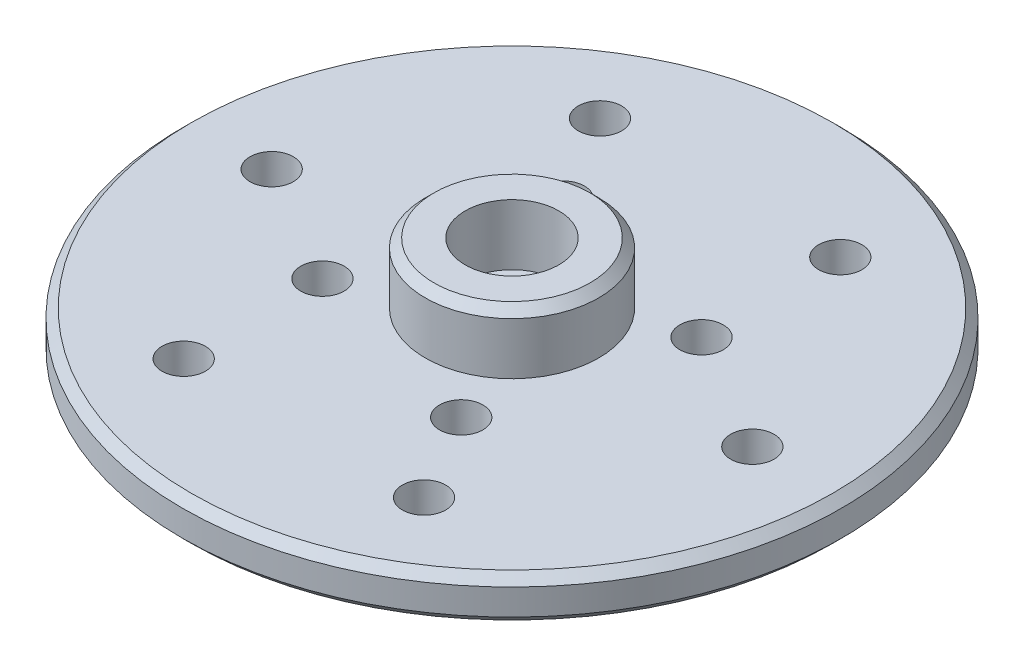
ISO-10303-21;
HEADER;
FILE_DESCRIPTION(('STEP AP214'),'2;1');
FILE_NAME('part.step','',(''),(''),'','','');
FILE_SCHEMA(('AUTOMOTIVE_DESIGN { 1 0 10303 214 1 1 1 1 }'));
ENDSEC;
DATA;
#1=APPLICATION_CONTEXT('core data for automotive mechanical design processes');
#2=APPLICATION_PROTOCOL_DEFINITION('international standard','automotive_design',2000,#1);
#3=PRODUCT_CONTEXT('',#1,'mechanical');
#4=PRODUCT('Part','Part','',(#3));
#5=PRODUCT_RELATED_PRODUCT_CATEGORY('part','',(#4));
#6=PRODUCT_DEFINITION_FORMATION('','',#4);
#7=PRODUCT_DEFINITION_CONTEXT('part definition',#1,'design');
#8=PRODUCT_DEFINITION('design','',#6,#7);
#9=PRODUCT_DEFINITION_SHAPE('','',#8);
#10=(LENGTH_UNIT() NAMED_UNIT(*) SI_UNIT(.MILLI.,.METRE.));
#11=(NAMED_UNIT(*) PLANE_ANGLE_UNIT() SI_UNIT($,.RADIAN.));
#12=(NAMED_UNIT(*) SI_UNIT($,.STERADIAN.) SOLID_ANGLE_UNIT());
#13=UNCERTAINTY_MEASURE_WITH_UNIT(LENGTH_MEASURE(1.E-05),#10,'distance_accuracy_value','');
#14=(GEOMETRIC_REPRESENTATION_CONTEXT(3) GLOBAL_UNCERTAINTY_ASSIGNED_CONTEXT((#13)) GLOBAL_UNIT_ASSIGNED_CONTEXT((#10,
#11,#12)) REPRESENTATION_CONTEXT('',''));
#15=CARTESIAN_POINT('',(0.,0.,0.));
#16=DIRECTION('',(0.,0.,1.));
#17=DIRECTION('',(1.,0.,0.));
#18=AXIS2_PLACEMENT_3D('',#15,#16,#17);
#19=CARTESIAN_POINT('',(0.,5.50000000004047,0.));
#20=DIRECTION('',(0.,-1.,0.));
#21=DIRECTION('',(0.,0.,-1.));
#22=AXIS2_PLACEMENT_3D('',#19,#20,#21);
#23=CONICAL_SURFACE('',#22,4.99999999999545,0.785398163397448);
#24=CARTESIAN_POINT('',(0.,5.49999999999999,0.));
#25=DIRECTION('',(0.,-1.,0.));
#26=DIRECTION('',(0.,0.,-1.));
#27=AXIS2_PLACEMENT_3D('',#24,#25,#26);
#28=CIRCLE('',#27,5.);
#29=CARTESIAN_POINT('',(0.,5.49999999999999,-5.));
#30=VERTEX_POINT('',#29);
#31=EDGE_CURVE('E28',#30,#30,#28,.T.);
#32=ORIENTED_EDGE('',*,*,#31,.F.);
#33=EDGE_LOOP('',(#32));
#34=FACE_BOUND('',#33,.T.);
#35=CARTESIAN_POINT('',(0.,6.00000000002865,0.));
#36=DIRECTION('',(0.,-1.,0.));
#37=DIRECTION('',(0.,0.,-1.));
#38=AXIS2_PLACEMENT_3D('',#35,#36,#37);
#39=CIRCLE('',#38,4.50000000000728);
#40=CARTESIAN_POINT('',(0.,6.00000000002865,-4.50000000000728));
#41=VERTEX_POINT('',#40);
#42=EDGE_CURVE('E16',#41,#41,#39,.F.);
#43=ORIENTED_EDGE('',*,*,#42,.F.);
#44=EDGE_LOOP('',(#43));
#45=FACE_BOUND('',#44,.T.);
#46=ADVANCED_FACE('F13',(#34,#45),#23,.T.);
#47=CARTESIAN_POINT('',(0.,6.,0.));
#48=DIRECTION('',(0.,1.,0.));
#49=DIRECTION('',(0.,0.,1.));
#50=AXIS2_PLACEMENT_3D('',#47,#48,#49);
#51=PLANE('',#50);
#52=CARTESIAN_POINT('',(0.,6.,0.));
#53=DIRECTION('',(0.,-1.,0.));
#54=DIRECTION('',(0.,0.,-1.));
#55=AXIS2_PLACEMENT_3D('',#52,#53,#54);
#56=CIRCLE('',#55,2.7);
#57=CARTESIAN_POINT('',(0.,6.,-2.7));
#58=VERTEX_POINT('',#57);
#59=EDGE_CURVE('E103',#58,#58,#56,.T.);
#60=ORIENTED_EDGE('',*,*,#59,.T.);
#61=EDGE_LOOP('',(#60));
#62=FACE_BOUND('',#61,.T.);
#63=ORIENTED_EDGE('',*,*,#42,.T.);
#64=EDGE_LOOP('',(#63));
#65=FACE_BOUND('',#64,.T.);
#66=ADVANCED_FACE('F114',(#62,#65),#51,.T.);
#67=CARTESIAN_POINT('',(0.,2.00000000000002,0.));
#68=DIRECTION('',(0.,-1.,0.));
#69=DIRECTION('',(0.,0.,-1.));
#70=AXIS2_PLACEMENT_3D('',#67,#68,#69);
#71=CONICAL_SURFACE('',#70,19.0000000009398,0.785398163397445);
#72=CARTESIAN_POINT('',(0.,2.00000000000002,0.));
#73=DIRECTION('',(0.,-1.,0.));
#74=DIRECTION('',(0.,0.,-1.));
#75=AXIS2_PLACEMENT_3D('',#72,#73,#74);
#76=CIRCLE('',#75,19.0000000009398);
#77=CARTESIAN_POINT('',(0.,2.00000000000002,-19.0000000009398));
#78=VERTEX_POINT('',#77);
#79=EDGE_CURVE('E102',#78,#78,#76,.T.);
#80=ORIENTED_EDGE('',*,*,#79,.F.);
#81=EDGE_LOOP('',(#80));
#82=FACE_BOUND('',#81,.T.);
#83=CARTESIAN_POINT('',(0.,2.5,0.));
#84=DIRECTION('',(0.,-1.,0.));
#85=DIRECTION('',(0.,0.,-1.));
#86=AXIS2_PLACEMENT_3D('',#83,#84,#85);
#87=CIRCLE('',#86,18.5000000009398);
#88=CARTESIAN_POINT('',(0.,2.5,-18.5000000009398));
#89=VERTEX_POINT('',#88);
#90=EDGE_CURVE('E100',#89,#89,#87,.F.);
#91=ORIENTED_EDGE('',*,*,#90,.F.);
#92=EDGE_LOOP('',(#91));
#93=FACE_BOUND('',#92,.T.);
#94=ADVANCED_FACE('F122',(#82,#93),#71,.T.);
#95=CARTESIAN_POINT('',(0.,6.,0.));
#96=DIRECTION('',(0.,-1.,0.));
#97=DIRECTION('',(0.,0.,-1.));
#98=AXIS2_PLACEMENT_3D('',#95,#96,#97);
#99=CYLINDRICAL_SURFACE('',#98,5.);
#100=CARTESIAN_POINT('',(0.,2.5,0.));
#101=DIRECTION('',(0.,-1.,0.));
#102=DIRECTION('',(0.,0.,-1.));
#103=AXIS2_PLACEMENT_3D('',#100,#101,#102);
#104=CIRCLE('',#103,5.);
#105=CARTESIAN_POINT('',(0.,2.5,-5.));
#106=VERTEX_POINT('',#105);
#107=EDGE_CURVE('E97',#106,#106,#104,.T.);
#108=ORIENTED_EDGE('',*,*,#107,.F.);
#109=EDGE_LOOP('',(#108));
#110=FACE_BOUND('',#109,.T.);
#111=ORIENTED_EDGE('',*,*,#31,.T.);
#112=EDGE_LOOP('',(#111));
#113=FACE_BOUND('',#112,.T.);
#114=ADVANCED_FACE('F193',(#110,#113),#99,.T.);
#115=CARTESIAN_POINT('',(0.,6.,0.));
#116=DIRECTION('',(0.,-1.,0.));
#117=DIRECTION('',(0.,0.,-1.));
#118=AXIS2_PLACEMENT_3D('',#115,#116,#117);
#119=CYLINDRICAL_SURFACE('',#118,2.7);
#120=CARTESIAN_POINT('',(0.,2.5,0.));
#121=DIRECTION('',(0.,-1.,0.));
#122=DIRECTION('',(0.,0.,-1.));
#123=AXIS2_PLACEMENT_3D('',#120,#121,#122);
#124=CIRCLE('',#123,2.7);
#125=CARTESIAN_POINT('',(0.,2.5,-2.7));
#126=VERTEX_POINT('',#125);
#127=EDGE_CURVE('E94',#126,#126,#124,.F.);
#128=ORIENTED_EDGE('',*,*,#127,.F.);
#129=EDGE_LOOP('',(#128));
#130=FACE_BOUND('',#129,.T.);
#131=ORIENTED_EDGE('',*,*,#59,.F.);
#132=EDGE_LOOP('',(#131));
#133=FACE_BOUND('',#132,.T.);
#134=ADVANCED_FACE('F189',(#130,#133),#119,.F.);
#135=CARTESIAN_POINT('',(0.,2.5,0.));
#136=DIRECTION('',(0.,-1.,0.));
#137=DIRECTION('',(0.,0.,-1.));
#138=AXIS2_PLACEMENT_3D('',#135,#136,#137);
#139=CYLINDRICAL_SURFACE('',#138,19.0000000009398);
#140=ORIENTED_EDGE('',*,*,#79,.T.);
#141=EDGE_LOOP('',(#140));
#142=FACE_BOUND('',#141,.T.);
#143=CARTESIAN_POINT('',(0.,0.499999999999997,0.));
#144=DIRECTION('',(0.,1.,0.));
#145=DIRECTION('',(0.,0.,1.));
#146=AXIS2_PLACEMENT_3D('',#143,#144,#145);
#147=CIRCLE('',#146,19.0000000009398);
#148=CARTESIAN_POINT('',(0.,0.499999999999997,19.0000000009398));
#149=VERTEX_POINT('',#148);
#150=EDGE_CURVE('E93',#149,#149,#147,.F.);
#151=ORIENTED_EDGE('',*,*,#150,.F.);
#152=EDGE_LOOP('',(#151));
#153=FACE_BOUND('',#152,.T.);
#154=ADVANCED_FACE('F185',(#142,#153),#139,.T.);
#155=CARTESIAN_POINT('',(0.,2.5,0.));
#156=DIRECTION('',(0.,1.,0.));
#157=DIRECTION('',(0.,0.,1.));
#158=AXIS2_PLACEMENT_3D('',#155,#156,#157);
#159=PLANE('',#158);
#160=CARTESIAN_POINT('',(4.0000000009961,2.5,6.92820323018273));
#161=DIRECTION('',(0.,-1.,0.));
#162=DIRECTION('',(0.,0.,-1.));
#163=AXIS2_PLACEMENT_3D('',#160,#161,#162);
#164=CIRCLE('',#163,1.24999999999886);
#165=CARTESIAN_POINT('',(4.0000000009961,2.5,5.67820323018386));
#166=VERTEX_POINT('',#165);
#167=EDGE_CURVE('E66',#166,#166,#164,.T.);
#168=ORIENTED_EDGE('',*,*,#167,.T.);
#169=EDGE_LOOP('',(#168));
#170=FACE_BOUND('',#169,.T.);
#171=CARTESIAN_POINT('',(-6.92820323019561,2.5,4.00000000097478));
#172=DIRECTION('',(0.,-1.,0.));
#173=DIRECTION('',(0.,0.,-1.));
#174=AXIS2_PLACEMENT_3D('',#171,#172,#173);
#175=CIRCLE('',#174,1.24999999999886);
#176=CARTESIAN_POINT('',(-6.92820323019561,2.5,2.75000000097592));
#177=VERTEX_POINT('',#176);
#178=EDGE_CURVE('E72',#177,#177,#175,.T.);
#179=ORIENTED_EDGE('',*,*,#178,.T.);
#180=EDGE_LOOP('',(#179));
#181=FACE_BOUND('',#180,.T.);
#182=CARTESIAN_POINT('',(-4.0000000010032,2.5,-6.92820323017962));
#183=DIRECTION('',(0.,-1.,0.));
#184=DIRECTION('',(0.,0.,-1.));
#185=AXIS2_PLACEMENT_3D('',#182,#183,#184);
#186=CIRCLE('',#185,1.24999999999886);
#187=CARTESIAN_POINT('',(-4.0000000010032,2.5,-8.17820323017848));
#188=VERTEX_POINT('',#187);
#189=EDGE_CURVE('E78',#188,#188,#186,.T.);
#190=ORIENTED_EDGE('',*,*,#189,.T.);
#191=EDGE_LOOP('',(#190));
#192=FACE_BOUND('',#191,.T.);
#193=CARTESIAN_POINT('',(13.8564064603592,2.5,0.));
#194=DIRECTION('',(0.,-1.,0.));
#195=DIRECTION('',(0.,0.,-1.));
#196=AXIS2_PLACEMENT_3D('',#193,#194,#195);
#197=CIRCLE('',#196,1.24999999999886);
#198=CARTESIAN_POINT('',(13.8564064603592,2.5,-1.24999999999886));
#199=VERTEX_POINT('',#198);
#200=EDGE_CURVE('E84',#199,#199,#197,.T.);
#201=ORIENTED_EDGE('',*,*,#200,.T.);
#202=EDGE_LOOP('',(#201));
#203=FACE_BOUND('',#202,.T.);
#204=CARTESIAN_POINT('',(-6.9282032318263,2.5,-11.9999999995111));
#205=DIRECTION('',(0.,-1.,0.));
#206=DIRECTION('',(0.,0.,-1.));
#207=AXIS2_PLACEMENT_3D('',#204,#205,#206);
#208=CIRCLE('',#207,1.24999999999886);
#209=CARTESIAN_POINT('',(-6.9282032318263,2.5,-13.2499999995099));
#210=VERTEX_POINT('',#209);
#211=EDGE_CURVE('E90',#210,#210,#208,.T.);
#212=ORIENTED_EDGE('',*,*,#211,.T.);
#213=EDGE_LOOP('',(#212));
#214=FACE_BOUND('',#213,.T.);
#215=CARTESIAN_POINT('',(6.92820322963072,2.5,-11.9999999995111));
#216=DIRECTION('',(0.,-1.,0.));
#217=DIRECTION('',(0.,0.,-1.));
#218=AXIS2_PLACEMENT_3D('',#215,#216,#217);
#219=CIRCLE('',#218,1.24999999999886);
#220=CARTESIAN_POINT('',(6.92820322963072,2.5,-13.2499999995099));
#221=VERTEX_POINT('',#220);
#222=EDGE_CURVE('E87',#221,#221,#219,.T.);
#223=ORIENTED_EDGE('',*,*,#222,.T.);
#224=EDGE_LOOP('',(#223));
#225=FACE_BOUND('',#224,.T.);
#226=CARTESIAN_POINT('',(6.92820323019561,2.5,-4.00000000097478));
#227=DIRECTION('',(0.,-1.,0.));
#228=DIRECTION('',(0.,0.,-1.));
#229=AXIS2_PLACEMENT_3D('',#226,#227,#228);
#230=CIRCLE('',#229,1.24999999999886);
#231=CARTESIAN_POINT('',(6.92820323019561,2.5,-5.25000000097364));
#232=VERTEX_POINT('',#231);
#233=EDGE_CURVE('E81',#232,#232,#230,.T.);
#234=ORIENTED_EDGE('',*,*,#233,.T.);
#235=EDGE_LOOP('',(#234));
#236=FACE_BOUND('',#235,.T.);
#237=CARTESIAN_POINT('',(-13.8564064609028,2.5,0.));
#238=DIRECTION('',(0.,-1.,0.));
#239=DIRECTION('',(0.,0.,-1.));
#240=AXIS2_PLACEMENT_3D('',#237,#238,#239);
#241=CIRCLE('',#240,1.24999999999886);
#242=CARTESIAN_POINT('',(-13.8564064609028,2.5,-1.24999999999886));
#243=VERTEX_POINT('',#242);
#244=EDGE_CURVE('E75',#243,#243,#241,.T.);
#245=ORIENTED_EDGE('',*,*,#244,.T.);
#246=EDGE_LOOP('',(#245));
#247=FACE_BOUND('',#246,.T.);
#248=CARTESIAN_POINT('',(-6.92820323017784,2.5,11.9999999979203));
#249=DIRECTION('',(0.,-1.,0.));
#250=DIRECTION('',(0.,0.,-1.));
#251=AXIS2_PLACEMENT_3D('',#248,#249,#250);
#252=CIRCLE('',#251,1.24999999999886);
#253=CARTESIAN_POINT('',(-6.92820323017784,2.5,10.7499999979215));
#254=VERTEX_POINT('',#253);
#255=EDGE_CURVE('E69',#254,#254,#252,.T.);
#256=ORIENTED_EDGE('',*,*,#255,.T.);
#257=EDGE_LOOP('',(#256));
#258=FACE_BOUND('',#257,.T.);
#259=CARTESIAN_POINT('',(6.9282032318192,2.5,11.9999999995146));
#260=DIRECTION('',(0.,-1.,0.));
#261=DIRECTION('',(0.,0.,-1.));
#262=AXIS2_PLACEMENT_3D('',#259,#260,#261);
#263=CIRCLE('',#262,1.24999999999886);
#264=CARTESIAN_POINT('',(6.9282032318192,2.5,10.7499999995158));
#265=VERTEX_POINT('',#264);
#266=EDGE_CURVE('E63',#265,#265,#263,.T.);
#267=ORIENTED_EDGE('',*,*,#266,.T.);
#268=EDGE_LOOP('',(#267));
#269=FACE_BOUND('',#268,.T.);
#270=ORIENTED_EDGE('',*,*,#107,.T.);
#271=EDGE_LOOP('',(#270));
#272=FACE_BOUND('',#271,.T.);
#273=ORIENTED_EDGE('',*,*,#90,.T.);
#274=EDGE_LOOP('',(#273));
#275=FACE_BOUND('',#274,.T.);
#276=ADVANCED_FACE('F181',(#170,#181,#192,#203,#214,#225,#236,#247,#258,#269,#272,#275),#159,.T.);
#277=CARTESIAN_POINT('',(0.,2.5,0.));
#278=DIRECTION('',(0.,1.,0.));
#279=DIRECTION('',(0.,0.,1.));
#280=AXIS2_PLACEMENT_3D('',#277,#278,#279);
#281=PLANE('',#280);
#282=ORIENTED_EDGE('',*,*,#127,.T.);
#283=EDGE_LOOP('',(#282));
#284=FACE_BOUND('',#283,.T.);
#285=CARTESIAN_POINT('',(0.,2.5,0.));
#286=DIRECTION('',(0.,-1.,0.));
#287=DIRECTION('',(0.,0.,-1.));
#288=AXIS2_PLACEMENT_3D('',#285,#286,#287);
#289=CIRCLE('',#288,1.6);
#290=CARTESIAN_POINT('',(0.,2.5,-1.6));
#291=VERTEX_POINT('',#290);
#292=EDGE_CURVE('E60',#291,#291,#289,.T.);
#293=ORIENTED_EDGE('',*,*,#292,.T.);
#294=EDGE_LOOP('',(#293));
#295=FACE_BOUND('',#294,.T.);
#296=ADVANCED_FACE('F177',(#284,#295),#281,.T.);
#297=CARTESIAN_POINT('',(0.,0.499999999999997,0.));
#298=DIRECTION('',(0.,1.,0.));
#299=DIRECTION('',(0.,0.,1.));
#300=AXIS2_PLACEMENT_3D('',#297,#298,#299);
#301=CONICAL_SURFACE('',#300,19.0000000009398,0.785398163397452);
#302=CARTESIAN_POINT('',(0.,0.,0.));
#303=DIRECTION('',(0.,1.,0.));
#304=DIRECTION('',(0.,0.,1.));
#305=AXIS2_PLACEMENT_3D('',#302,#303,#304);
#306=CIRCLE('',#305,18.5000000009398);
#307=CARTESIAN_POINT('',(0.,0.,18.5000000009398));
#308=VERTEX_POINT('',#307);
#309=EDGE_CURVE('E57',#308,#308,#306,.T.);
#310=ORIENTED_EDGE('',*,*,#309,.T.);
#311=EDGE_LOOP('',(#310));
#312=FACE_BOUND('',#311,.T.);
#313=ORIENTED_EDGE('',*,*,#150,.T.);
#314=EDGE_LOOP('',(#313));
#315=FACE_BOUND('',#314,.T.);
#316=ADVANCED_FACE('F173',(#312,#315),#301,.T.);
#317=CARTESIAN_POINT('',(-6.9282032318263,2.5,-11.9999999995111));
#318=DIRECTION('',(0.,-1.,0.));
#319=DIRECTION('',(0.,0.,-1.));
#320=AXIS2_PLACEMENT_3D('',#317,#318,#319);
#321=CYLINDRICAL_SURFACE('',#320,1.24999999999886);
#322=CARTESIAN_POINT('',(-6.9282032318263,0.,-11.9999999995111));
#323=DIRECTION('',(0.,-1.,0.));
#324=DIRECTION('',(0.,0.,-1.));
#325=AXIS2_PLACEMENT_3D('',#322,#323,#324);
#326=CIRCLE('',#325,1.24999999999886);
#327=CARTESIAN_POINT('',(-6.9282032318263,0.,-13.2499999995099));
#328=VERTEX_POINT('',#327);
#329=EDGE_CURVE('E54',#328,#328,#326,.T.);
#330=ORIENTED_EDGE('',*,*,#329,.T.);
#331=EDGE_LOOP('',(#330));
#332=FACE_BOUND('',#331,.T.);
#333=ORIENTED_EDGE('',*,*,#211,.F.);
#334=EDGE_LOOP('',(#333));
#335=FACE_BOUND('',#334,.T.);
#336=ADVANCED_FACE('F169',(#332,#335),#321,.F.);
#337=CARTESIAN_POINT('',(6.92820322963072,2.5,-11.9999999995111));
#338=DIRECTION('',(0.,-1.,0.));
#339=DIRECTION('',(0.,0.,-1.));
#340=AXIS2_PLACEMENT_3D('',#337,#338,#339);
#341=CYLINDRICAL_SURFACE('',#340,1.24999999999886);
#342=CARTESIAN_POINT('',(6.92820322963072,0.,-11.9999999995111));
#343=DIRECTION('',(0.,-1.,0.));
#344=DIRECTION('',(0.,0.,-1.));
#345=AXIS2_PLACEMENT_3D('',#342,#343,#344);
#346=CIRCLE('',#345,1.24999999999886);
#347=CARTESIAN_POINT('',(6.92820322963072,0.,-13.2499999995099));
#348=VERTEX_POINT('',#347);
#349=EDGE_CURVE('E51',#348,#348,#346,.T.);
#350=ORIENTED_EDGE('',*,*,#349,.T.);
#351=EDGE_LOOP('',(#350));
#352=FACE_BOUND('',#351,.T.);
#353=ORIENTED_EDGE('',*,*,#222,.F.);
#354=EDGE_LOOP('',(#353));
#355=FACE_BOUND('',#354,.T.);
#356=ADVANCED_FACE('F165',(#352,#355),#341,.F.);
#357=CARTESIAN_POINT('',(13.8564064603592,2.5,0.));
#358=DIRECTION('',(0.,-1.,0.));
#359=DIRECTION('',(0.,0.,-1.));
#360=AXIS2_PLACEMENT_3D('',#357,#358,#359);
#361=CYLINDRICAL_SURFACE('',#360,1.24999999999886);
#362=CARTESIAN_POINT('',(13.8564064603592,0.,0.));
#363=DIRECTION('',(0.,-1.,0.));
#364=DIRECTION('',(0.,0.,-1.));
#365=AXIS2_PLACEMENT_3D('',#362,#363,#364);
#366=CIRCLE('',#365,1.24999999999886);
#367=CARTESIAN_POINT('',(13.8564064603592,0.,-1.24999999999886));
#368=VERTEX_POINT('',#367);
#369=EDGE_CURVE('E48',#368,#368,#366,.T.);
#370=ORIENTED_EDGE('',*,*,#369,.T.);
#371=EDGE_LOOP('',(#370));
#372=FACE_BOUND('',#371,.T.);
#373=ORIENTED_EDGE('',*,*,#200,.F.);
#374=EDGE_LOOP('',(#373));
#375=FACE_BOUND('',#374,.T.);
#376=ADVANCED_FACE('F161',(#372,#375),#361,.F.);
#377=CARTESIAN_POINT('',(6.92820323019561,2.5,-4.00000000097478));
#378=DIRECTION('',(0.,-1.,0.));
#379=DIRECTION('',(0.,0.,-1.));
#380=AXIS2_PLACEMENT_3D('',#377,#378,#379);
#381=CYLINDRICAL_SURFACE('',#380,1.24999999999886);
#382=CARTESIAN_POINT('',(6.92820323019561,0.,-4.00000000097478));
#383=DIRECTION('',(0.,-1.,0.));
#384=DIRECTION('',(0.,0.,-1.));
#385=AXIS2_PLACEMENT_3D('',#382,#383,#384);
#386=CIRCLE('',#385,1.24999999999886);
#387=CARTESIAN_POINT('',(6.92820323019561,0.,-5.25000000097364));
#388=VERTEX_POINT('',#387);
#389=EDGE_CURVE('E45',#388,#388,#386,.T.);
#390=ORIENTED_EDGE('',*,*,#389,.T.);
#391=EDGE_LOOP('',(#390));
#392=FACE_BOUND('',#391,.T.);
#393=ORIENTED_EDGE('',*,*,#233,.F.);
#394=EDGE_LOOP('',(#393));
#395=FACE_BOUND('',#394,.T.);
#396=ADVANCED_FACE('F157',(#392,#395),#381,.F.);
#397=CARTESIAN_POINT('',(-4.0000000010032,2.5,-6.92820323017962));
#398=DIRECTION('',(0.,-1.,0.));
#399=DIRECTION('',(0.,0.,-1.));
#400=AXIS2_PLACEMENT_3D('',#397,#398,#399);
#401=CYLINDRICAL_SURFACE('',#400,1.24999999999886);
#402=CARTESIAN_POINT('',(-4.0000000010032,0.,-6.92820323017962));
#403=DIRECTION('',(0.,-1.,0.));
#404=DIRECTION('',(0.,0.,-1.));
#405=AXIS2_PLACEMENT_3D('',#402,#403,#404);
#406=CIRCLE('',#405,1.24999999999886);
#407=CARTESIAN_POINT('',(-4.0000000010032,0.,-8.17820323017848));
#408=VERTEX_POINT('',#407);
#409=EDGE_CURVE('E42',#408,#408,#406,.T.);
#410=ORIENTED_EDGE('',*,*,#409,.T.);
#411=EDGE_LOOP('',(#410));
#412=FACE_BOUND('',#411,.T.);
#413=ORIENTED_EDGE('',*,*,#189,.F.);
#414=EDGE_LOOP('',(#413));
#415=FACE_BOUND('',#414,.T.);
#416=ADVANCED_FACE('F153',(#412,#415),#401,.F.);
#417=CARTESIAN_POINT('',(-13.8564064609028,2.5,0.));
#418=DIRECTION('',(0.,-1.,0.));
#419=DIRECTION('',(0.,0.,-1.));
#420=AXIS2_PLACEMENT_3D('',#417,#418,#419);
#421=CYLINDRICAL_SURFACE('',#420,1.24999999999886);
#422=CARTESIAN_POINT('',(-13.8564064609028,0.,0.));
#423=DIRECTION('',(0.,-1.,0.));
#424=DIRECTION('',(0.,0.,-1.));
#425=AXIS2_PLACEMENT_3D('',#422,#423,#424);
#426=CIRCLE('',#425,1.24999999999886);
#427=CARTESIAN_POINT('',(-13.8564064609028,0.,-1.24999999999886));
#428=VERTEX_POINT('',#427);
#429=EDGE_CURVE('E39',#428,#428,#426,.T.);
#430=ORIENTED_EDGE('',*,*,#429,.T.);
#431=EDGE_LOOP('',(#430));
#432=FACE_BOUND('',#431,.T.);
#433=ORIENTED_EDGE('',*,*,#244,.F.);
#434=EDGE_LOOP('',(#433));
#435=FACE_BOUND('',#434,.T.);
#436=ADVANCED_FACE('F149',(#432,#435),#421,.F.);
#437=CARTESIAN_POINT('',(-6.92820323019561,2.5,4.00000000097478));
#438=DIRECTION('',(0.,-1.,0.));
#439=DIRECTION('',(0.,0.,-1.));
#440=AXIS2_PLACEMENT_3D('',#437,#438,#439);
#441=CYLINDRICAL_SURFACE('',#440,1.24999999999886);
#442=CARTESIAN_POINT('',(-6.92820323019561,0.,4.00000000097478));
#443=DIRECTION('',(0.,-1.,0.));
#444=DIRECTION('',(0.,0.,-1.));
#445=AXIS2_PLACEMENT_3D('',#442,#443,#444);
#446=CIRCLE('',#445,1.24999999999886);
#447=CARTESIAN_POINT('',(-6.92820323019561,0.,2.75000000097592));
#448=VERTEX_POINT('',#447);
#449=EDGE_CURVE('E36',#448,#448,#446,.T.);
#450=ORIENTED_EDGE('',*,*,#449,.T.);
#451=EDGE_LOOP('',(#450));
#452=FACE_BOUND('',#451,.T.);
#453=ORIENTED_EDGE('',*,*,#178,.F.);
#454=EDGE_LOOP('',(#453));
#455=FACE_BOUND('',#454,.T.);
#456=ADVANCED_FACE('F145',(#452,#455),#441,.F.);
#457=CARTESIAN_POINT('',(-6.92820323017784,2.5,11.9999999979203));
#458=DIRECTION('',(0.,-1.,0.));
#459=DIRECTION('',(0.,0.,-1.));
#460=AXIS2_PLACEMENT_3D('',#457,#458,#459);
#461=CYLINDRICAL_SURFACE('',#460,1.24999999999886);
#462=CARTESIAN_POINT('',(-6.92820323017784,0.,11.9999999979203));
#463=DIRECTION('',(0.,-1.,0.));
#464=DIRECTION('',(0.,0.,-1.));
#465=AXIS2_PLACEMENT_3D('',#462,#463,#464);
#466=CIRCLE('',#465,1.24999999999886);
#467=CARTESIAN_POINT('',(-6.92820323017784,0.,10.7499999979215));
#468=VERTEX_POINT('',#467);
#469=EDGE_CURVE('E33',#468,#468,#466,.T.);
#470=ORIENTED_EDGE('',*,*,#469,.T.);
#471=EDGE_LOOP('',(#470));
#472=FACE_BOUND('',#471,.T.);
#473=ORIENTED_EDGE('',*,*,#255,.F.);
#474=EDGE_LOOP('',(#473));
#475=FACE_BOUND('',#474,.T.);
#476=ADVANCED_FACE('F141',(#472,#475),#461,.F.);
#477=CARTESIAN_POINT('',(4.0000000009961,2.5,6.92820323018273));
#478=DIRECTION('',(0.,-1.,0.));
#479=DIRECTION('',(0.,0.,-1.));
#480=AXIS2_PLACEMENT_3D('',#477,#478,#479);
#481=CYLINDRICAL_SURFACE('',#480,1.24999999999886);
#482=CARTESIAN_POINT('',(4.0000000009961,0.,6.92820323018273));
#483=DIRECTION('',(0.,-1.,0.));
#484=DIRECTION('',(0.,0.,-1.));
#485=AXIS2_PLACEMENT_3D('',#482,#483,#484);
#486=CIRCLE('',#485,1.24999999999886);
#487=CARTESIAN_POINT('',(4.0000000009961,0.,5.67820323018386));
#488=VERTEX_POINT('',#487);
#489=EDGE_CURVE('E25',#488,#488,#486,.T.);
#490=ORIENTED_EDGE('',*,*,#489,.T.);
#491=EDGE_LOOP('',(#490));
#492=FACE_BOUND('',#491,.T.);
#493=ORIENTED_EDGE('',*,*,#167,.F.);
#494=EDGE_LOOP('',(#493));
#495=FACE_BOUND('',#494,.T.);
#496=ADVANCED_FACE('F137',(#492,#495),#481,.F.);
#497=CARTESIAN_POINT('',(6.9282032318192,2.5,11.9999999995146));
#498=DIRECTION('',(0.,-1.,0.));
#499=DIRECTION('',(0.,0.,-1.));
#500=AXIS2_PLACEMENT_3D('',#497,#498,#499);
#501=CYLINDRICAL_SURFACE('',#500,1.24999999999886);
#502=CARTESIAN_POINT('',(6.9282032318192,0.,11.9999999995146));
#503=DIRECTION('',(0.,-1.,0.));
#504=DIRECTION('',(0.,0.,-1.));
#505=AXIS2_PLACEMENT_3D('',#502,#503,#504);
#506=CIRCLE('',#505,1.24999999999886);
#507=CARTESIAN_POINT('',(6.9282032318192,0.,10.7499999995158));
#508=VERTEX_POINT('',#507);
#509=EDGE_CURVE('E20',#508,#508,#506,.T.);
#510=ORIENTED_EDGE('',*,*,#509,.T.);
#511=EDGE_LOOP('',(#510));
#512=FACE_BOUND('',#511,.T.);
#513=ORIENTED_EDGE('',*,*,#266,.F.);
#514=EDGE_LOOP('',(#513));
#515=FACE_BOUND('',#514,.T.);
#516=ADVANCED_FACE('F131',(#512,#515),#501,.F.);
#517=CARTESIAN_POINT('',(0.,2.5,0.));
#518=DIRECTION('',(0.,-1.,0.));
#519=DIRECTION('',(0.,0.,-1.));
#520=AXIS2_PLACEMENT_3D('',#517,#518,#519);
#521=CYLINDRICAL_SURFACE('',#520,1.6);
#522=CARTESIAN_POINT('',(0.,0.,0.));
#523=DIRECTION('',(0.,-1.,0.));
#524=DIRECTION('',(0.,0.,-1.));
#525=AXIS2_PLACEMENT_3D('',#522,#523,#524);
#526=CIRCLE('',#525,1.6);
#527=CARTESIAN_POINT('',(0.,0.,-1.6));
#528=VERTEX_POINT('',#527);
#529=EDGE_CURVE('E9',#528,#528,#526,.T.);
#530=ORIENTED_EDGE('',*,*,#529,.T.);
#531=EDGE_LOOP('',(#530));
#532=FACE_BOUND('',#531,.T.);
#533=ORIENTED_EDGE('',*,*,#292,.F.);
#534=EDGE_LOOP('',(#533));
#535=FACE_BOUND('',#534,.T.);
#536=ADVANCED_FACE('F125',(#532,#535),#521,.F.);
#537=CARTESIAN_POINT('',(0.,0.,0.));
#538=DIRECTION('',(0.,1.,0.));
#539=DIRECTION('',(0.,0.,1.));
#540=AXIS2_PLACEMENT_3D('',#537,#538,#539);
#541=PLANE('',#540);
#542=ORIENTED_EDGE('',*,*,#529,.F.);
#543=EDGE_LOOP('',(#542));
#544=FACE_BOUND('',#543,.T.);
#545=ORIENTED_EDGE('',*,*,#509,.F.);
#546=EDGE_LOOP('',(#545));
#547=FACE_BOUND('',#546,.T.);
#548=ORIENTED_EDGE('',*,*,#489,.F.);
#549=EDGE_LOOP('',(#548));
#550=FACE_BOUND('',#549,.T.);
#551=ORIENTED_EDGE('',*,*,#469,.F.);
#552=EDGE_LOOP('',(#551));
#553=FACE_BOUND('',#552,.T.);
#554=ORIENTED_EDGE('',*,*,#449,.F.);
#555=EDGE_LOOP('',(#554));
#556=FACE_BOUND('',#555,.T.);
#557=ORIENTED_EDGE('',*,*,#429,.F.);
#558=EDGE_LOOP('',(#557));
#559=FACE_BOUND('',#558,.T.);
#560=ORIENTED_EDGE('',*,*,#409,.F.);
#561=EDGE_LOOP('',(#560));
#562=FACE_BOUND('',#561,.T.);
#563=ORIENTED_EDGE('',*,*,#389,.F.);
#564=EDGE_LOOP('',(#563));
#565=FACE_BOUND('',#564,.T.);
#566=ORIENTED_EDGE('',*,*,#369,.F.);
#567=EDGE_LOOP('',(#566));
#568=FACE_BOUND('',#567,.T.);
#569=ORIENTED_EDGE('',*,*,#349,.F.);
#570=EDGE_LOOP('',(#569));
#571=FACE_BOUND('',#570,.T.);
#572=ORIENTED_EDGE('',*,*,#329,.F.);
#573=EDGE_LOOP('',(#572));
#574=FACE_BOUND('',#573,.T.);
#575=ORIENTED_EDGE('',*,*,#309,.F.);
#576=EDGE_LOOP('',(#575));
#577=FACE_BOUND('',#576,.T.);
#578=ADVANCED_FACE('F123',(#544,#547,#550,#553,#556,#559,#562,#565,#568,#571,#574,#577),#541,.F.);
#579=CLOSED_SHELL('',(#46,#66,#94,#114,#134,#154,#276,#296,#316,#336,#356,#376,#396,#416,#436,
#456,#476,#496,#516,#536,#578));
#580=MANIFOLD_SOLID_BREP('B1',#579);
#581=ADVANCED_BREP_SHAPE_REPRESENTATION('',(#18,#580),#14);
#582=SHAPE_DEFINITION_REPRESENTATION(#9,#581);
ENDSEC;
END-ISO-10303-21;
